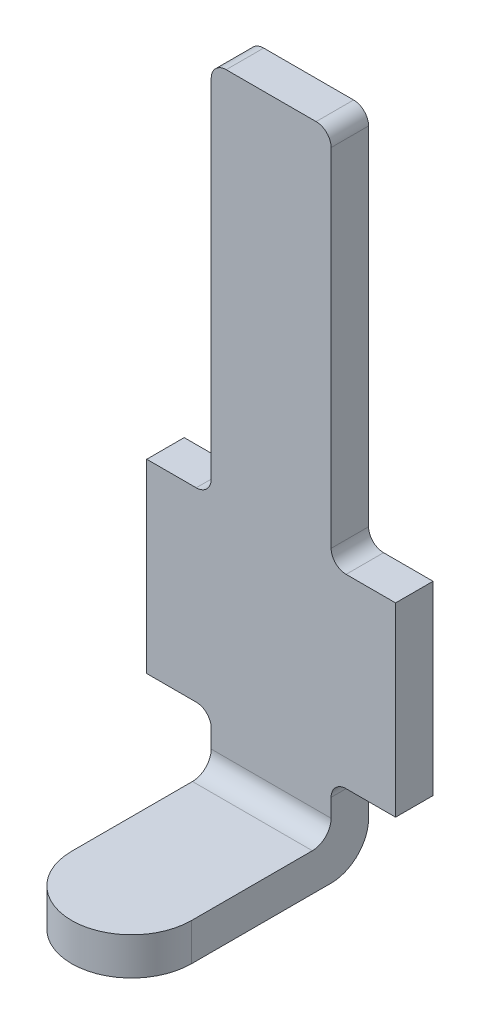
ISO-10303-21;
HEADER;
FILE_DESCRIPTION(('STEP AP214'),'2;1');
FILE_NAME('part.step','',(''),(''),'','','');
FILE_SCHEMA(('AUTOMOTIVE_DESIGN { 1 0 10303 214 1 1 1 1 }'));
ENDSEC;
DATA;
#1=APPLICATION_CONTEXT('core data for automotive mechanical design processes');
#2=APPLICATION_PROTOCOL_DEFINITION('international standard','automotive_design',2000,#1);
#3=PRODUCT_CONTEXT('',#1,'mechanical');
#4=PRODUCT('Part','Part','',(#3));
#5=PRODUCT_RELATED_PRODUCT_CATEGORY('part','',(#4));
#6=PRODUCT_DEFINITION_FORMATION('','',#4);
#7=PRODUCT_DEFINITION_CONTEXT('part definition',#1,'design');
#8=PRODUCT_DEFINITION('design','',#6,#7);
#9=PRODUCT_DEFINITION_SHAPE('','',#8);
#10=(LENGTH_UNIT() NAMED_UNIT(*) SI_UNIT(.MILLI.,.METRE.));
#11=(NAMED_UNIT(*) PLANE_ANGLE_UNIT() SI_UNIT($,.RADIAN.));
#12=(NAMED_UNIT(*) SI_UNIT($,.STERADIAN.) SOLID_ANGLE_UNIT());
#13=UNCERTAINTY_MEASURE_WITH_UNIT(LENGTH_MEASURE(1.E-05),#10,'distance_accuracy_value','');
#14=(GEOMETRIC_REPRESENTATION_CONTEXT(3) GLOBAL_UNCERTAINTY_ASSIGNED_CONTEXT((#13)) GLOBAL_UNIT_ASSIGNED_CONTEXT((#10,
#11,#12)) REPRESENTATION_CONTEXT('',''));
#15=CARTESIAN_POINT('',(0.,0.,0.));
#16=DIRECTION('',(0.,0.,1.));
#17=DIRECTION('',(1.,0.,0.));
#18=AXIS2_PLACEMENT_3D('',#15,#16,#17);
#19=CARTESIAN_POINT('',(-11.93,0.0459658151929143,0.749000000000012));
#20=DIRECTION('',(0.,0.,-1.));
#21=DIRECTION('',(-1.,0.,0.));
#22=AXIS2_PLACEMENT_3D('',#19,#20,#21);
#23=CYLINDRICAL_SURFACE('',#22,0.1);
#24=CARTESIAN_POINT('',(-11.93,0.0459658151929143,0.498999999999983));
#25=DIRECTION('',(0.,0.,1.));
#26=DIRECTION('',(1.,0.,0.));
#27=AXIS2_PLACEMENT_3D('',#24,#25,#26);
#28=CIRCLE('',#27,0.1);
#29=CARTESIAN_POINT('',(-11.83,0.0459658151929143,0.498999999999983));
#30=VERTEX_POINT('',#29);
#31=CARTESIAN_POINT('',(-11.93,0.145965815192914,0.499000000000012));
#32=VERTEX_POINT('',#31);
#33=EDGE_CURVE('E357',#30,#32,#28,.T.);
#34=ORIENTED_EDGE('',*,*,#33,.F.);
#35=DIRECTION('',(0.,0.,-1.));
#36=VECTOR('',#35,1.);
#37=CARTESIAN_POINT('',(-11.83,0.0459658151929143,0.499000000000012));
#38=LINE('',#37,#36);
#39=CARTESIAN_POINT('',(-11.83,0.0459658151929143,0.748999999999983));
#40=VERTEX_POINT('',#39);
#41=EDGE_CURVE('E253',#40,#30,#38,.T.);
#42=ORIENTED_EDGE('',*,*,#41,.F.);
#43=CARTESIAN_POINT('',(-11.93,0.0459658151929143,0.748999999999983));
#44=DIRECTION('',(0.,0.,-1.));
#45=DIRECTION('',(-1.,0.,0.));
#46=AXIS2_PLACEMENT_3D('',#43,#44,#45);
#47=CIRCLE('',#46,0.1);
#48=CARTESIAN_POINT('',(-11.93,0.145965815192914,0.749000000000012));
#49=VERTEX_POINT('',#48);
#50=EDGE_CURVE('E232',#49,#40,#47,.T.);
#51=ORIENTED_EDGE('',*,*,#50,.F.);
#52=DIRECTION('',(0.,0.,1.));
#53=VECTOR('',#52,1.);
#54=CARTESIAN_POINT('',(-11.93,0.145965815192914,0.748999999999983));
#55=LINE('',#54,#53);
#56=EDGE_CURVE('E349',#32,#49,#55,.T.);
#57=ORIENTED_EDGE('',*,*,#56,.F.);
#58=EDGE_LOOP('',(#34,#42,#51,#57));
#59=FACE_BOUND('',#58,.T.);
#60=ADVANCED_FACE('F16',(#59),#23,.F.);
#61=CARTESIAN_POINT('',(-10.93,0.0459658151929143,0.748999999999984));
#62=DIRECTION('',(0.,0.,1.));
#63=DIRECTION('',(1.,0.,0.));
#64=AXIS2_PLACEMENT_3D('',#61,#62,#63);
#65=CYLINDRICAL_SURFACE('',#64,0.1);
#66=CARTESIAN_POINT('',(-10.93,0.0459658151929143,0.498999999999984));
#67=DIRECTION('',(0.,0.,1.));
#68=DIRECTION('',(1.,0.,0.));
#69=AXIS2_PLACEMENT_3D('',#66,#67,#68);
#70=CIRCLE('',#69,0.1);
#71=CARTESIAN_POINT('',(-10.93,0.145965815192914,0.499000000000013));
#72=VERTEX_POINT('',#71);
#73=CARTESIAN_POINT('',(-11.03,0.0459658151929143,0.498999999999984));
#74=VERTEX_POINT('',#73);
#75=EDGE_CURVE('E275',#72,#74,#70,.T.);
#76=ORIENTED_EDGE('',*,*,#75,.F.);
#77=DIRECTION('',(0.,0.,-1.));
#78=VECTOR('',#77,1.);
#79=CARTESIAN_POINT('',(-10.93,0.145965815192914,0.749000000000013));
#80=LINE('',#79,#78);
#81=CARTESIAN_POINT('',(-10.93,0.145965815192914,0.749000000000013));
#82=VERTEX_POINT('',#81);
#83=EDGE_CURVE('E27',#82,#72,#80,.T.);
#84=ORIENTED_EDGE('',*,*,#83,.F.);
#85=CARTESIAN_POINT('',(-10.93,0.0459658151929143,0.748999999999984));
#86=DIRECTION('',(0.,0.,-1.));
#87=DIRECTION('',(-1.,0.,0.));
#88=AXIS2_PLACEMENT_3D('',#85,#86,#87);
#89=CIRCLE('',#88,0.1);
#90=CARTESIAN_POINT('',(-11.03,0.0459658151929143,0.748999999999984));
#91=VERTEX_POINT('',#90);
#92=EDGE_CURVE('E203',#91,#82,#89,.T.);
#93=ORIENTED_EDGE('',*,*,#92,.F.);
#94=DIRECTION('',(0.,0.,1.));
#95=VECTOR('',#94,1.);
#96=CARTESIAN_POINT('',(-11.03,0.0459658151929143,0.748999999999984));
#97=LINE('',#96,#95);
#98=EDGE_CURVE('E186',#74,#91,#97,.T.);
#99=ORIENTED_EDGE('',*,*,#98,.F.);
#100=EDGE_LOOP('',(#76,#84,#93,#99));
#101=FACE_BOUND('',#100,.T.);
#102=ADVANCED_FACE('F204',(#101),#65,.F.);
#103=CARTESIAN_POINT('',(-11.93,1.48437551370885,0.748999999999983));
#104=DIRECTION('',(0.,0.,1.));
#105=DIRECTION('',(1.,0.,0.));
#106=AXIS2_PLACEMENT_3D('',#103,#104,#105);
#107=CYLINDRICAL_SURFACE('',#106,0.1);
#108=CARTESIAN_POINT('',(-11.93,1.48437551370885,0.498999999999983));
#109=DIRECTION('',(0.,0.,1.));
#110=DIRECTION('',(1.,0.,0.));
#111=AXIS2_PLACEMENT_3D('',#108,#109,#110);
#112=CIRCLE('',#111,0.1);
#113=CARTESIAN_POINT('',(-11.93,1.38437551370885,0.499000000000012));
#114=VERTEX_POINT('',#113);
#115=CARTESIAN_POINT('',(-11.83,1.48437551370885,0.498999999999983));
#116=VERTEX_POINT('',#115);
#117=EDGE_CURVE('E360',#114,#116,#112,.T.);
#118=ORIENTED_EDGE('',*,*,#117,.F.);
#119=DIRECTION('',(0.,0.,-1.));
#120=VECTOR('',#119,1.);
#121=CARTESIAN_POINT('',(-11.93,1.38437551370885,0.749000000000012));
#122=LINE('',#121,#120);
#123=CARTESIAN_POINT('',(-11.93,1.38437551370885,0.749000000000012));
#124=VERTEX_POINT('',#123);
#125=EDGE_CURVE('E42',#124,#114,#122,.T.);
#126=ORIENTED_EDGE('',*,*,#125,.F.);
#127=CARTESIAN_POINT('',(-11.93,1.48437551370885,0.748999999999983));
#128=DIRECTION('',(0.,0.,-1.));
#129=DIRECTION('',(-1.,0.,0.));
#130=AXIS2_PLACEMENT_3D('',#127,#128,#129);
#131=CIRCLE('',#130,0.1);
#132=CARTESIAN_POINT('',(-11.83,1.48437551370885,0.748999999999983));
#133=VERTEX_POINT('',#132);
#134=EDGE_CURVE('E313',#133,#124,#131,.T.);
#135=ORIENTED_EDGE('',*,*,#134,.F.);
#136=DIRECTION('',(0.,0.,1.));
#137=VECTOR('',#136,1.);
#138=CARTESIAN_POINT('',(-11.83,1.48437551370885,0.748999999999983));
#139=LINE('',#138,#137);
#140=EDGE_CURVE('E279',#116,#133,#139,.T.);
#141=ORIENTED_EDGE('',*,*,#140,.F.);
#142=EDGE_LOOP('',(#118,#126,#135,#141));
#143=FACE_BOUND('',#142,.T.);
#144=ADVANCED_FACE('F483',(#143),#107,.F.);
#145=CARTESIAN_POINT('',(-10.93,1.48437551370885,0.749000000000014));
#146=DIRECTION('',(0.,0.,-1.));
#147=DIRECTION('',(-1.,0.,0.));
#148=AXIS2_PLACEMENT_3D('',#145,#146,#147);
#149=CYLINDRICAL_SURFACE('',#148,0.1);
#150=CARTESIAN_POINT('',(-10.93,1.48437551370885,0.498999999999985));
#151=DIRECTION('',(0.,0.,1.));
#152=DIRECTION('',(1.,0.,0.));
#153=AXIS2_PLACEMENT_3D('',#150,#151,#152);
#154=CIRCLE('',#153,0.1);
#155=CARTESIAN_POINT('',(-11.03,1.48437551370885,0.498999999999984));
#156=VERTEX_POINT('',#155);
#157=CARTESIAN_POINT('',(-10.93,1.38437551370885,0.499000000000013));
#158=VERTEX_POINT('',#157);
#159=EDGE_CURVE('E265',#156,#158,#154,.T.);
#160=ORIENTED_EDGE('',*,*,#159,.F.);
#161=DIRECTION('',(0.,0.,-1.));
#162=VECTOR('',#161,1.);
#163=CARTESIAN_POINT('',(-11.03,1.48437551370885,0.498999999999984));
#164=LINE('',#163,#162);
#165=CARTESIAN_POINT('',(-11.03,1.48437551370885,0.748999999999984));
#166=VERTEX_POINT('',#165);
#167=EDGE_CURVE('E257',#166,#156,#164,.T.);
#168=ORIENTED_EDGE('',*,*,#167,.F.);
#169=CARTESIAN_POINT('',(-10.93,1.48437551370885,0.748999999999984));
#170=DIRECTION('',(0.,0.,-1.));
#171=DIRECTION('',(-1.,0.,0.));
#172=AXIS2_PLACEMENT_3D('',#169,#170,#171);
#173=CIRCLE('',#172,0.1);
#174=CARTESIAN_POINT('',(-10.93,1.38437551370885,0.749000000000014));
#175=VERTEX_POINT('',#174);
#176=EDGE_CURVE('E238',#175,#166,#173,.T.);
#177=ORIENTED_EDGE('',*,*,#176,.F.);
#178=DIRECTION('',(0.,0.,1.));
#179=VECTOR('',#178,1.);
#180=CARTESIAN_POINT('',(-10.93,1.38437551370885,0.748999999999984));
#181=LINE('',#180,#179);
#182=EDGE_CURVE('E338',#158,#175,#181,.T.);
#183=ORIENTED_EDGE('',*,*,#182,.F.);
#184=EDGE_LOOP('',(#160,#168,#177,#183));
#185=FACE_BOUND('',#184,.T.);
#186=ADVANCED_FACE('F534',(#185),#149,.F.);
#187=CARTESIAN_POINT('',(-11.73,3.8,0.748999999999983));
#188=DIRECTION('',(0.,0.,-1.));
#189=DIRECTION('',(-1.,0.,0.));
#190=AXIS2_PLACEMENT_3D('',#187,#188,#189);
#191=CYLINDRICAL_SURFACE('',#190,0.1);
#192=CARTESIAN_POINT('',(-11.73,3.8,0.498999999999984));
#193=DIRECTION('',(0.,0.,-1.));
#194=DIRECTION('',(1.,0.,0.));
#195=AXIS2_PLACEMENT_3D('',#192,#193,#194);
#196=CIRCLE('',#195,0.1);
#197=CARTESIAN_POINT('',(-11.83,3.8,0.498999999999984));
#198=VERTEX_POINT('',#197);
#199=CARTESIAN_POINT('',(-11.73,3.9,0.498999999999984));
#200=VERTEX_POINT('',#199);
#201=EDGE_CURVE('E200',#198,#200,#196,.T.);
#202=ORIENTED_EDGE('',*,*,#201,.F.);
#203=DIRECTION('',(0.,0.,-1.));
#204=VECTOR('',#203,1.);
#205=CARTESIAN_POINT('',(-11.83,3.8,0.498999999999984));
#206=LINE('',#205,#204);
#207=CARTESIAN_POINT('',(-11.83,3.8,0.748999999999983));
#208=VERTEX_POINT('',#207);
#209=EDGE_CURVE('E315',#208,#198,#206,.T.);
#210=ORIENTED_EDGE('',*,*,#209,.F.);
#211=CARTESIAN_POINT('',(-11.73,3.8,0.748999999999983));
#212=DIRECTION('',(0.,0.,1.));
#213=DIRECTION('',(-1.,0.,0.));
#214=AXIS2_PLACEMENT_3D('',#211,#212,#213);
#215=CIRCLE('',#214,0.1);
#216=CARTESIAN_POINT('',(-11.73,3.9,0.748999999999983));
#217=VERTEX_POINT('',#216);
#218=EDGE_CURVE('E291',#217,#208,#215,.T.);
#219=ORIENTED_EDGE('',*,*,#218,.F.);
#220=DIRECTION('',(0.,0.,1.));
#221=VECTOR('',#220,1.);
#222=CARTESIAN_POINT('',(-11.73,3.9,0.748999999999983));
#223=LINE('',#222,#221);
#224=EDGE_CURVE('E292',#200,#217,#223,.T.);
#225=ORIENTED_EDGE('',*,*,#224,.F.);
#226=EDGE_LOOP('',(#202,#210,#219,#225));
#227=FACE_BOUND('',#226,.T.);
#228=ADVANCED_FACE('F546',(#227),#191,.T.);
#229=CARTESIAN_POINT('',(-11.13,3.8,0.748999999999984));
#230=DIRECTION('',(0.,0.,1.));
#231=DIRECTION('',(1.,0.,0.));
#232=AXIS2_PLACEMENT_3D('',#229,#230,#231);
#233=CYLINDRICAL_SURFACE('',#232,0.1);
#234=CARTESIAN_POINT('',(-11.13,3.8,0.498999999999985));
#235=DIRECTION('',(0.,0.,-1.));
#236=DIRECTION('',(1.,0.,0.));
#237=AXIS2_PLACEMENT_3D('',#234,#235,#236);
#238=CIRCLE('',#237,0.1);
#239=CARTESIAN_POINT('',(-11.13,3.9,0.498999999999985));
#240=VERTEX_POINT('',#239);
#241=CARTESIAN_POINT('',(-11.03,3.8,0.498999999999985));
#242=VERTEX_POINT('',#241);
#243=EDGE_CURVE('E310',#240,#242,#238,.T.);
#244=ORIENTED_EDGE('',*,*,#243,.F.);
#245=DIRECTION('',(0.,0.,-1.));
#246=VECTOR('',#245,1.);
#247=CARTESIAN_POINT('',(-11.13,3.9,0.748999999999984));
#248=LINE('',#247,#246);
#249=CARTESIAN_POINT('',(-11.13,3.9,0.748999999999984));
#250=VERTEX_POINT('',#249);
#251=EDGE_CURVE('E331',#250,#240,#248,.T.);
#252=ORIENTED_EDGE('',*,*,#251,.F.);
#253=CARTESIAN_POINT('',(-11.13,3.8,0.748999999999984));
#254=DIRECTION('',(0.,0.,1.));
#255=DIRECTION('',(-1.,0.,0.));
#256=AXIS2_PLACEMENT_3D('',#253,#254,#255);
#257=CIRCLE('',#256,0.1);
#258=CARTESIAN_POINT('',(-11.03,3.8,0.748999999999984));
#259=VERTEX_POINT('',#258);
#260=EDGE_CURVE('E288',#259,#250,#257,.T.);
#261=ORIENTED_EDGE('',*,*,#260,.F.);
#262=DIRECTION('',(0.,0.,1.));
#263=VECTOR('',#262,1.);
#264=CARTESIAN_POINT('',(-11.03,3.8,0.748999999999984));
#265=LINE('',#264,#263);
#266=EDGE_CURVE('E258',#242,#259,#265,.T.);
#267=ORIENTED_EDGE('',*,*,#266,.F.);
#268=EDGE_LOOP('',(#244,#252,#261,#267));
#269=FACE_BOUND('',#268,.T.);
#270=ADVANCED_FACE('F542',(#269),#233,.T.);
#271=CARTESIAN_POINT('',(-10.6,0.,1.00308650274883E-13));
#272=DIRECTION('',(-1.,0.,0.));
#273=DIRECTION('',(0.,0.,1.));
#274=AXIS2_PLACEMENT_3D('',#271,#272,#273);
#275=PLANE('',#274);
#276=DIRECTION('',(0.,0.,-1.));
#277=VECTOR('',#276,1.);
#278=CARTESIAN_POINT('',(-10.6,1.38437551370885,0.749000000000014));
#279=LINE('',#278,#277);
#280=CARTESIAN_POINT('',(-10.6,1.38437551370885,0.749000000000014));
#281=VERTEX_POINT('',#280);
#282=CARTESIAN_POINT('',(-10.6,1.38437551370885,0.499000000000014));
#283=VERTEX_POINT('',#282);
#284=EDGE_CURVE('E299',#281,#283,#279,.T.);
#285=ORIENTED_EDGE('',*,*,#284,.F.);
#286=DIRECTION('',(0.,-1.,0.));
#287=VECTOR('',#286,1.);
#288=CARTESIAN_POINT('',(-10.6,1.38437551370885,0.749000000000014));
#289=LINE('',#288,#287);
#290=CARTESIAN_POINT('',(-10.6,0.145965815192914,0.749000000000014));
#291=VERTEX_POINT('',#290);
#292=EDGE_CURVE('E239',#281,#291,#289,.T.);
#293=ORIENTED_EDGE('',*,*,#292,.T.);
#294=DIRECTION('',(0.,0.,-1.));
#295=VECTOR('',#294,1.);
#296=CARTESIAN_POINT('',(-10.6,0.145965815192914,0.749000000000014));
#297=LINE('',#296,#295);
#298=CARTESIAN_POINT('',(-10.6,0.145965815192914,0.499000000000014));
#299=VERTEX_POINT('',#298);
#300=EDGE_CURVE('E11',#291,#299,#297,.T.);
#301=ORIENTED_EDGE('',*,*,#300,.T.);
#302=DIRECTION('',(0.,-1.,0.));
#303=VECTOR('',#302,1.);
#304=CARTESIAN_POINT('',(-10.6,1.38437551370885,0.499000000000014));
#305=LINE('',#304,#303);
#306=EDGE_CURVE('E264',#283,#299,#305,.T.);
#307=ORIENTED_EDGE('',*,*,#306,.F.);
#308=EDGE_LOOP('',(#285,#293,#301,#307));
#309=FACE_BOUND('',#308,.T.);
#310=ADVANCED_FACE('F526',(#309),#275,.F.);
#311=CARTESIAN_POINT('',(-12.26,0.145965815192914,0.749000000000011));
#312=DIRECTION('',(0.,-1.,0.));
#313=DIRECTION('',(0.,0.,-1.));
#314=AXIS2_PLACEMENT_3D('',#311,#312,#313);
#315=PLANE('',#314);
#316=DIRECTION('',(1.,0.,0.));
#317=VECTOR('',#316,1.);
#318=CARTESIAN_POINT('',(-12.26,0.145965815192914,0.749000000000011));
#319=LINE('',#318,#317);
#320=EDGE_CURVE('E210',#82,#291,#319,.T.);
#321=ORIENTED_EDGE('',*,*,#320,.F.);
#322=ORIENTED_EDGE('',*,*,#83,.T.);
#323=DIRECTION('',(1.,0.,0.));
#324=VECTOR('',#323,1.);
#325=CARTESIAN_POINT('',(-12.26,0.145965815192914,0.499000000000011));
#326=LINE('',#325,#324);
#327=EDGE_CURVE('E278',#72,#299,#326,.T.);
#328=ORIENTED_EDGE('',*,*,#327,.T.);
#329=ORIENTED_EDGE('',*,*,#300,.F.);
#330=EDGE_LOOP('',(#321,#322,#328,#329));
#331=FACE_BOUND('',#330,.T.);
#332=ADVANCED_FACE('F522',(#331),#315,.T.);
#333=CARTESIAN_POINT('',(-12.26,1.38437551370885,0.749000000000012));
#334=DIRECTION('',(0.,-1.,0.));
#335=DIRECTION('',(0.,0.,-1.));
#336=AXIS2_PLACEMENT_3D('',#333,#334,#335);
#337=PLANE('',#336);
#338=DIRECTION('',(1.,0.,0.));
#339=VECTOR('',#338,1.);
#340=CARTESIAN_POINT('',(-12.26,1.38437551370885,0.499000000000011));
#341=LINE('',#340,#339);
#342=EDGE_CURVE('E260',#158,#283,#341,.T.);
#343=ORIENTED_EDGE('',*,*,#342,.F.);
#344=ORIENTED_EDGE('',*,*,#182,.T.);
#345=DIRECTION('',(1.,0.,0.));
#346=VECTOR('',#345,1.);
#347=CARTESIAN_POINT('',(-12.26,1.38437551370885,0.749000000000012));
#348=LINE('',#347,#346);
#349=EDGE_CURVE('E234',#175,#281,#348,.T.);
#350=ORIENTED_EDGE('',*,*,#349,.T.);
#351=ORIENTED_EDGE('',*,*,#284,.T.);
#352=EDGE_LOOP('',(#343,#344,#350,#351));
#353=FACE_BOUND('',#352,.T.);
#354=ADVANCED_FACE('F532',(#353),#337,.F.);
#355=CARTESIAN_POINT('',(-12.26,1.38437551370885,0.749000000000012));
#356=DIRECTION('',(0.,-1.,0.));
#357=DIRECTION('',(0.,0.,-1.));
#358=AXIS2_PLACEMENT_3D('',#355,#356,#357);
#359=PLANE('',#358);
#360=DIRECTION('',(1.,0.,0.));
#361=VECTOR('',#360,1.);
#362=CARTESIAN_POINT('',(-12.26,1.38437551370885,0.749000000000012));
#363=LINE('',#362,#361);
#364=CARTESIAN_POINT('',(-12.26,1.38437551370885,0.749000000000012));
#365=VERTEX_POINT('',#364);
#366=EDGE_CURVE('E311',#365,#124,#363,.T.);
#367=ORIENTED_EDGE('',*,*,#366,.T.);
#368=ORIENTED_EDGE('',*,*,#125,.T.);
#369=DIRECTION('',(1.,0.,0.));
#370=VECTOR('',#369,1.);
#371=CARTESIAN_POINT('',(-12.26,1.38437551370885,0.499000000000011));
#372=LINE('',#371,#370);
#373=CARTESIAN_POINT('',(-12.26,1.38437551370885,0.499000000000011));
#374=VERTEX_POINT('',#373);
#375=EDGE_CURVE('E383',#374,#114,#372,.T.);
#376=ORIENTED_EDGE('',*,*,#375,.F.);
#377=DIRECTION('',(0.,0.,-1.));
#378=VECTOR('',#377,1.);
#379=CARTESIAN_POINT('',(-12.26,1.38437551370885,0.749000000000012));
#380=LINE('',#379,#378);
#381=EDGE_CURVE('E252',#365,#374,#380,.T.);
#382=ORIENTED_EDGE('',*,*,#381,.F.);
#383=EDGE_LOOP('',(#367,#368,#376,#382));
#384=FACE_BOUND('',#383,.T.);
#385=ADVANCED_FACE('F583',(#384),#359,.F.);
#386=CARTESIAN_POINT('',(-12.26,0.145965815192914,0.749000000000011));
#387=DIRECTION('',(0.,-1.,0.));
#388=DIRECTION('',(0.,0.,-1.));
#389=AXIS2_PLACEMENT_3D('',#386,#387,#388);
#390=PLANE('',#389);
#391=DIRECTION('',(1.,0.,0.));
#392=VECTOR('',#391,1.);
#393=CARTESIAN_POINT('',(-12.26,0.145965815192914,0.499000000000011));
#394=LINE('',#393,#392);
#395=CARTESIAN_POINT('',(-12.26,0.145965815192914,0.499000000000011));
#396=VERTEX_POINT('',#395);
#397=EDGE_CURVE('E394',#396,#32,#394,.T.);
#398=ORIENTED_EDGE('',*,*,#397,.T.);
#399=ORIENTED_EDGE('',*,*,#56,.T.);
#400=DIRECTION('',(1.,0.,0.));
#401=VECTOR('',#400,1.);
#402=CARTESIAN_POINT('',(-12.26,0.145965815192914,0.749000000000011));
#403=LINE('',#402,#401);
#404=CARTESIAN_POINT('',(-12.26,0.145965815192914,0.749000000000011));
#405=VERTEX_POINT('',#404);
#406=EDGE_CURVE('E228',#405,#49,#403,.T.);
#407=ORIENTED_EDGE('',*,*,#406,.F.);
#408=DIRECTION('',(0.,0.,-1.));
#409=VECTOR('',#408,1.);
#410=CARTESIAN_POINT('',(-12.26,0.145965815192914,0.749000000000011));
#411=LINE('',#410,#409);
#412=EDGE_CURVE('E363',#405,#396,#411,.T.);
#413=ORIENTED_EDGE('',*,*,#412,.T.);
#414=EDGE_LOOP('',(#398,#399,#407,#413));
#415=FACE_BOUND('',#414,.T.);
#416=ADVANCED_FACE('F506',(#415),#390,.T.);
#417=CARTESIAN_POINT('',(-12.26,0.,0.));
#418=DIRECTION('',(-1.,0.,0.));
#419=DIRECTION('',(0.,0.,1.));
#420=AXIS2_PLACEMENT_3D('',#417,#418,#419);
#421=PLANE('',#420);
#422=ORIENTED_EDGE('',*,*,#381,.T.);
#423=DIRECTION('',(0.,-1.,0.));
#424=VECTOR('',#423,1.);
#425=CARTESIAN_POINT('',(-12.26,1.38437551370885,0.499000000000011));
#426=LINE('',#425,#424);
#427=EDGE_CURVE('E20',#374,#396,#426,.T.);
#428=ORIENTED_EDGE('',*,*,#427,.T.);
#429=ORIENTED_EDGE('',*,*,#412,.F.);
#430=DIRECTION('',(0.,-1.,0.));
#431=VECTOR('',#430,1.);
#432=CARTESIAN_POINT('',(-12.26,1.38437551370885,0.749000000000012));
#433=LINE('',#432,#431);
#434=EDGE_CURVE('E233',#365,#405,#433,.T.);
#435=ORIENTED_EDGE('',*,*,#434,.F.);
#436=EDGE_LOOP('',(#422,#428,#429,#435));
#437=FACE_BOUND('',#436,.T.);
#438=ADVANCED_FACE('F510',(#437),#421,.T.);
#439=CARTESIAN_POINT('',(-11.43,-0.2,1.68));
#440=DIRECTION('',(0.,-1.,0.));
#441=DIRECTION('',(0.,0.,-1.));
#442=AXIS2_PLACEMENT_3D('',#439,#440,#441);
#443=CYLINDRICAL_SURFACE('',#442,0.4);
#444=DIRECTION('',(0.,-1.,0.));
#445=VECTOR('',#444,1.);
#446=CARTESIAN_POINT('',(-11.03,-0.2,1.68));
#447=LINE('',#446,#445);
#448=CARTESIAN_POINT('',(-11.03,-0.2,1.68));
#449=VERTEX_POINT('',#448);
#450=CARTESIAN_POINT('',(-11.03,-0.45,1.68));
#451=VERTEX_POINT('',#450);
#452=EDGE_CURVE('E199',#449,#451,#447,.T.);
#453=ORIENTED_EDGE('',*,*,#452,.F.);
#454=CARTESIAN_POINT('',(-11.43,-0.2,1.68));
#455=DIRECTION('',(0.,1.,0.));
#456=DIRECTION('',(0.,0.,-1.));
#457=AXIS2_PLACEMENT_3D('',#454,#455,#456);
#458=CIRCLE('',#457,0.4);
#459=CARTESIAN_POINT('',(-11.83,-0.2,1.68));
#460=VERTEX_POINT('',#459);
#461=EDGE_CURVE('E345',#460,#449,#458,.T.);
#462=ORIENTED_EDGE('',*,*,#461,.F.);
#463=DIRECTION('',(0.,1.,0.));
#464=VECTOR('',#463,1.);
#465=CARTESIAN_POINT('',(-11.83,-0.2,1.68));
#466=LINE('',#465,#464);
#467=CARTESIAN_POINT('',(-11.83,-0.45,1.68));
#468=VERTEX_POINT('',#467);
#469=EDGE_CURVE('E249',#468,#460,#466,.T.);
#470=ORIENTED_EDGE('',*,*,#469,.F.);
#471=CARTESIAN_POINT('',(-11.43,-0.45,1.68));
#472=DIRECTION('',(0.,-1.,0.));
#473=DIRECTION('',(0.,0.,1.));
#474=AXIS2_PLACEMENT_3D('',#471,#472,#473);
#475=CIRCLE('',#474,0.4);
#476=EDGE_CURVE('E248',#451,#468,#475,.T.);
#477=ORIENTED_EDGE('',*,*,#476,.F.);
#478=EDGE_LOOP('',(#453,#462,#470,#477));
#479=FACE_BOUND('',#478,.T.);
#480=ADVANCED_FACE('F441',(#479),#443,.T.);
#481=CARTESIAN_POINT('',(-11.83,-0.2,0.748999999999983));
#482=DIRECTION('',(-1.,0.,0.));
#483=DIRECTION('',(0.,0.,1.));
#484=AXIS2_PLACEMENT_3D('',#481,#482,#483);
#485=PLANE('',#484);
#486=DIRECTION('',(0.,-1.,0.));
#487=VECTOR('',#486,1.);
#488=CARTESIAN_POINT('',(-11.83,3.9,0.748999999999983));
#489=LINE('',#488,#487);
#490=CARTESIAN_POINT('',(-11.83,-0.0749999999999988,0.748999999999983));
#491=VERTEX_POINT('',#490);
#492=EDGE_CURVE('E222',#40,#491,#489,.T.);
#493=ORIENTED_EDGE('',*,*,#492,.F.);
#494=ORIENTED_EDGE('',*,*,#41,.T.);
#495=DIRECTION('',(0.,1.,0.));
#496=VECTOR('',#495,1.);
#497=CARTESIAN_POINT('',(-11.83,3.9,0.498999999999984));
#498=LINE('',#497,#496);
#499=CARTESIAN_POINT('',(-11.83,-0.2,0.498999999999983));
#500=VERTEX_POINT('',#499);
#501=EDGE_CURVE('E353',#500,#30,#498,.T.);
#502=ORIENTED_EDGE('',*,*,#501,.F.);
#503=CARTESIAN_POINT('',(-11.83,-0.2,0.748999999999983));
#504=DIRECTION('',(1.,0.,0.));
#505=DIRECTION('',(0.,0.,1.));
#506=AXIS2_PLACEMENT_3D('',#503,#504,#505);
#507=CIRCLE('',#506,0.25);
#508=CARTESIAN_POINT('',(-11.83,-0.45,0.748999999999983));
#509=VERTEX_POINT('',#508);
#510=EDGE_CURVE('E274',#509,#500,#507,.T.);
#511=ORIENTED_EDGE('',*,*,#510,.F.);
#512=DIRECTION('',(0.,0.,-1.));
#513=VECTOR('',#512,1.);
#514=CARTESIAN_POINT('',(-11.83,-0.45,0.748999999999983));
#515=LINE('',#514,#513);
#516=EDGE_CURVE('E243',#468,#509,#515,.T.);
#517=ORIENTED_EDGE('',*,*,#516,.F.);
#518=ORIENTED_EDGE('',*,*,#469,.T.);
#519=DIRECTION('',(0.,0.,1.));
#520=VECTOR('',#519,1.);
#521=CARTESIAN_POINT('',(-11.83,-0.2,0.873999999999983));
#522=LINE('',#521,#520);
#523=CARTESIAN_POINT('',(-11.83,-0.2,0.873999999999983));
#524=VERTEX_POINT('',#523);
#525=EDGE_CURVE('E341',#524,#460,#522,.T.);
#526=ORIENTED_EDGE('',*,*,#525,.F.);
#527=CARTESIAN_POINT('',(-11.83,-0.0749999999999988,0.873999999999983));
#528=DIRECTION('',(-1.,0.,0.));
#529=DIRECTION('',(0.,0.,1.));
#530=AXIS2_PLACEMENT_3D('',#527,#528,#529);
#531=CIRCLE('',#530,0.125);
#532=EDGE_CURVE('E302',#491,#524,#531,.T.);
#533=ORIENTED_EDGE('',*,*,#532,.F.);
#534=EDGE_LOOP('',(#493,#494,#502,#511,#517,#518,#526,#533));
#535=FACE_BOUND('',#534,.T.);
#536=ADVANCED_FACE('F453',(#535),#485,.T.);
#537=CARTESIAN_POINT('',(-11.03,-0.2,0.748999999999984));
#538=DIRECTION('',(-1.,0.,0.));
#539=DIRECTION('',(0.,0.,1.));
#540=AXIS2_PLACEMENT_3D('',#537,#538,#539);
#541=PLANE('',#540);
#542=DIRECTION('',(0.,1.,0.));
#543=VECTOR('',#542,1.);
#544=CARTESIAN_POINT('',(-11.03,3.9,0.498999999999985));
#545=LINE('',#544,#543);
#546=CARTESIAN_POINT('',(-11.03,-0.2,0.498999999999984));
#547=VERTEX_POINT('',#546);
#548=EDGE_CURVE('E194',#547,#74,#545,.T.);
#549=ORIENTED_EDGE('',*,*,#548,.T.);
#550=ORIENTED_EDGE('',*,*,#98,.T.);
#551=DIRECTION('',(0.,-1.,0.));
#552=VECTOR('',#551,1.);
#553=CARTESIAN_POINT('',(-11.03,3.9,0.748999999999984));
#554=LINE('',#553,#552);
#555=CARTESIAN_POINT('',(-11.03,-0.0749999999999988,0.748999999999984));
#556=VERTEX_POINT('',#555);
#557=EDGE_CURVE('E191',#91,#556,#554,.T.);
#558=ORIENTED_EDGE('',*,*,#557,.T.);
#559=CARTESIAN_POINT('',(-11.03,-0.0749999999999988,0.873999999999984));
#560=DIRECTION('',(-1.,0.,0.));
#561=DIRECTION('',(0.,0.,1.));
#562=AXIS2_PLACEMENT_3D('',#559,#560,#561);
#563=CIRCLE('',#562,0.125);
#564=CARTESIAN_POINT('',(-11.03,-0.2,0.873999999999984));
#565=VERTEX_POINT('',#564);
#566=EDGE_CURVE('E346',#556,#565,#563,.T.);
#567=ORIENTED_EDGE('',*,*,#566,.T.);
#568=DIRECTION('',(0.,0.,1.));
#569=VECTOR('',#568,1.);
#570=CARTESIAN_POINT('',(-11.03,-0.2,0.873999999999984));
#571=LINE('',#570,#569);
#572=EDGE_CURVE('E269',#565,#449,#571,.T.);
#573=ORIENTED_EDGE('',*,*,#572,.T.);
#574=ORIENTED_EDGE('',*,*,#452,.T.);
#575=DIRECTION('',(0.,0.,-1.));
#576=VECTOR('',#575,1.);
#577=CARTESIAN_POINT('',(-11.03,-0.45,0.748999999999984));
#578=LINE('',#577,#576);
#579=CARTESIAN_POINT('',(-11.03,-0.45,0.748999999999984));
#580=VERTEX_POINT('',#579);
#581=EDGE_CURVE('E295',#451,#580,#578,.T.);
#582=ORIENTED_EDGE('',*,*,#581,.T.);
#583=CARTESIAN_POINT('',(-11.03,-0.2,0.748999999999984));
#584=DIRECTION('',(1.,0.,0.));
#585=DIRECTION('',(0.,0.,1.));
#586=AXIS2_PLACEMENT_3D('',#583,#584,#585);
#587=CIRCLE('',#586,0.25);
#588=EDGE_CURVE('E226',#580,#547,#587,.T.);
#589=ORIENTED_EDGE('',*,*,#588,.T.);
#590=EDGE_LOOP('',(#549,#550,#558,#567,#573,#574,#582,#589));
#591=FACE_BOUND('',#590,.T.);
#592=ADVANCED_FACE('F188',(#591),#541,.F.);
#593=CARTESIAN_POINT('',(-11.03,3.9,0.498999999999985));
#594=DIRECTION('',(0.,0.,1.));
#595=DIRECTION('',(1.,0.,0.));
#596=AXIS2_PLACEMENT_3D('',#593,#594,#595);
#597=PLANE('',#596);
#598=DIRECTION('',(-1.,0.,0.));
#599=VECTOR('',#598,1.);
#600=CARTESIAN_POINT('',(-11.03,3.9,0.498999999999985));
#601=LINE('',#600,#599);
#602=EDGE_CURVE('E306',#240,#200,#601,.T.);
#603=ORIENTED_EDGE('',*,*,#602,.F.);
#604=ORIENTED_EDGE('',*,*,#243,.T.);
#605=DIRECTION('',(0.,1.,0.));
#606=VECTOR('',#605,1.);
#607=CARTESIAN_POINT('',(-11.03,3.9,0.498999999999985));
#608=LINE('',#607,#606);
#609=EDGE_CURVE('E367',#156,#242,#608,.T.);
#610=ORIENTED_EDGE('',*,*,#609,.F.);
#611=ORIENTED_EDGE('',*,*,#159,.T.);
#612=ORIENTED_EDGE('',*,*,#342,.T.);
#613=ORIENTED_EDGE('',*,*,#306,.T.);
#614=ORIENTED_EDGE('',*,*,#327,.F.);
#615=ORIENTED_EDGE('',*,*,#75,.T.);
#616=ORIENTED_EDGE('',*,*,#548,.F.);
#617=DIRECTION('',(-1.,0.,0.));
#618=VECTOR('',#617,1.);
#619=CARTESIAN_POINT('',(-11.03,-0.2,0.498999999999984));
#620=LINE('',#619,#618);
#621=EDGE_CURVE('E270',#547,#500,#620,.T.);
#622=ORIENTED_EDGE('',*,*,#621,.T.);
#623=ORIENTED_EDGE('',*,*,#501,.T.);
#624=ORIENTED_EDGE('',*,*,#33,.T.);
#625=ORIENTED_EDGE('',*,*,#397,.F.);
#626=ORIENTED_EDGE('',*,*,#427,.F.);
#627=ORIENTED_EDGE('',*,*,#375,.T.);
#628=ORIENTED_EDGE('',*,*,#117,.T.);
#629=DIRECTION('',(0.,1.,0.));
#630=VECTOR('',#629,1.);
#631=CARTESIAN_POINT('',(-11.83,3.9,0.498999999999984));
#632=LINE('',#631,#630);
#633=EDGE_CURVE('E284',#116,#198,#632,.T.);
#634=ORIENTED_EDGE('',*,*,#633,.T.);
#635=ORIENTED_EDGE('',*,*,#201,.T.);
#636=EDGE_LOOP('',(#603,#604,#610,#611,#612,#613,#614,#615,#616,#622,#623,#624,#625,#626,#627,
#628,#634,#635));
#637=FACE_BOUND('',#636,.T.);
#638=ADVANCED_FACE('F465',(#637),#597,.F.);
#639=CARTESIAN_POINT('',(-11.03,-0.2,0.748999999999984));
#640=DIRECTION('',(-1.,0.,0.));
#641=DIRECTION('',(0.,0.,1.));
#642=AXIS2_PLACEMENT_3D('',#639,#640,#641);
#643=CYLINDRICAL_SURFACE('',#642,0.25);
#644=ORIENTED_EDGE('',*,*,#510,.T.);
#645=ORIENTED_EDGE('',*,*,#621,.F.);
#646=ORIENTED_EDGE('',*,*,#588,.F.);
#647=DIRECTION('',(-1.,0.,0.));
#648=VECTOR('',#647,1.);
#649=CARTESIAN_POINT('',(-11.03,-0.45,0.748999999999984));
#650=LINE('',#649,#648);
#651=EDGE_CURVE('E247',#580,#509,#650,.T.);
#652=ORIENTED_EDGE('',*,*,#651,.T.);
#653=EDGE_LOOP('',(#644,#645,#646,#652));
#654=FACE_BOUND('',#653,.T.);
#655=ADVANCED_FACE('F462',(#654),#643,.T.);
#656=CARTESIAN_POINT('',(-11.03,-0.45,0.748999999999984));
#657=DIRECTION('',(0.,1.,0.));
#658=DIRECTION('',(0.,0.,-1.));
#659=AXIS2_PLACEMENT_3D('',#656,#657,#658);
#660=PLANE('',#659);
#661=ORIENTED_EDGE('',*,*,#476,.T.);
#662=ORIENTED_EDGE('',*,*,#516,.T.);
#663=ORIENTED_EDGE('',*,*,#651,.F.);
#664=ORIENTED_EDGE('',*,*,#581,.F.);
#665=EDGE_LOOP('',(#661,#662,#663,#664));
#666=FACE_BOUND('',#665,.T.);
#667=ADVANCED_FACE('F458',(#666),#660,.F.);
#668=CARTESIAN_POINT('',(-11.03,-0.2,0.873999999999984));
#669=DIRECTION('',(0.,-1.,0.));
#670=DIRECTION('',(0.,0.,-1.));
#671=AXIS2_PLACEMENT_3D('',#668,#669,#670);
#672=PLANE('',#671);
#673=ORIENTED_EDGE('',*,*,#525,.T.);
#674=ORIENTED_EDGE('',*,*,#461,.T.);
#675=ORIENTED_EDGE('',*,*,#572,.F.);
#676=DIRECTION('',(-1.,0.,0.));
#677=VECTOR('',#676,1.);
#678=CARTESIAN_POINT('',(-11.03,-0.2,0.873999999999984));
#679=LINE('',#678,#677);
#680=EDGE_CURVE('E379',#565,#524,#679,.T.);
#681=ORIENTED_EDGE('',*,*,#680,.T.);
#682=EDGE_LOOP('',(#673,#674,#675,#681));
#683=FACE_BOUND('',#682,.T.);
#684=ADVANCED_FACE('F449',(#683),#672,.F.);
#685=CARTESIAN_POINT('',(-11.03,-0.0749999999999988,0.873999999999984));
#686=DIRECTION('',(-1.,0.,0.));
#687=DIRECTION('',(0.,0.,1.));
#688=AXIS2_PLACEMENT_3D('',#685,#686,#687);
#689=CYLINDRICAL_SURFACE('',#688,0.125);
#690=ORIENTED_EDGE('',*,*,#532,.T.);
#691=ORIENTED_EDGE('',*,*,#680,.F.);
#692=ORIENTED_EDGE('',*,*,#566,.F.);
#693=DIRECTION('',(-1.,0.,0.));
#694=VECTOR('',#693,1.);
#695=CARTESIAN_POINT('',(-11.03,-0.0749999999999988,0.748999999999984));
#696=LINE('',#695,#694);
#697=EDGE_CURVE('E216',#556,#491,#696,.T.);
#698=ORIENTED_EDGE('',*,*,#697,.T.);
#699=EDGE_LOOP('',(#690,#691,#692,#698));
#700=FACE_BOUND('',#699,.T.);
#701=ADVANCED_FACE('F580',(#700),#689,.F.);
#702=CARTESIAN_POINT('',(-11.03,3.9,0.748999999999984));
#703=DIRECTION('',(0.,0.,-1.));
#704=DIRECTION('',(0.,-1.,0.));
#705=AXIS2_PLACEMENT_3D('',#702,#703,#704);
#706=PLANE('',#705);
#707=DIRECTION('',(0.,-1.,0.));
#708=VECTOR('',#707,1.);
#709=CARTESIAN_POINT('',(-11.03,3.9,0.748999999999984));
#710=LINE('',#709,#708);
#711=EDGE_CURVE('E254',#259,#166,#710,.T.);
#712=ORIENTED_EDGE('',*,*,#711,.F.);
#713=ORIENTED_EDGE('',*,*,#260,.T.);
#714=DIRECTION('',(-1.,0.,0.));
#715=VECTOR('',#714,1.);
#716=CARTESIAN_POINT('',(-11.03,3.9,0.748999999999984));
#717=LINE('',#716,#715);
#718=EDGE_CURVE('E283',#250,#217,#717,.T.);
#719=ORIENTED_EDGE('',*,*,#718,.T.);
#720=ORIENTED_EDGE('',*,*,#218,.T.);
#721=DIRECTION('',(0.,-1.,0.));
#722=VECTOR('',#721,1.);
#723=CARTESIAN_POINT('',(-11.83,3.9,0.748999999999983));
#724=LINE('',#723,#722);
#725=EDGE_CURVE('E319',#208,#133,#724,.T.);
#726=ORIENTED_EDGE('',*,*,#725,.T.);
#727=ORIENTED_EDGE('',*,*,#134,.T.);
#728=ORIENTED_EDGE('',*,*,#366,.F.);
#729=ORIENTED_EDGE('',*,*,#434,.T.);
#730=ORIENTED_EDGE('',*,*,#406,.T.);
#731=ORIENTED_EDGE('',*,*,#50,.T.);
#732=ORIENTED_EDGE('',*,*,#492,.T.);
#733=ORIENTED_EDGE('',*,*,#697,.F.);
#734=ORIENTED_EDGE('',*,*,#557,.F.);
#735=ORIENTED_EDGE('',*,*,#92,.T.);
#736=ORIENTED_EDGE('',*,*,#320,.T.);
#737=ORIENTED_EDGE('',*,*,#292,.F.);
#738=ORIENTED_EDGE('',*,*,#349,.F.);
#739=ORIENTED_EDGE('',*,*,#176,.T.);
#740=EDGE_LOOP('',(#712,#713,#719,#720,#726,#727,#728,#729,#730,#731,#732,#733,#734,#735,#736,
#737,#738,#739));
#741=FACE_BOUND('',#740,.T.);
#742=ADVANCED_FACE('F213',(#741),#706,.F.);
#743=CARTESIAN_POINT('',(-11.03,3.9,0.748999999999984));
#744=DIRECTION('',(0.,-1.,0.));
#745=DIRECTION('',(0.,0.,-1.));
#746=AXIS2_PLACEMENT_3D('',#743,#744,#745);
#747=PLANE('',#746);
#748=ORIENTED_EDGE('',*,*,#718,.F.);
#749=ORIENTED_EDGE('',*,*,#251,.T.);
#750=ORIENTED_EDGE('',*,*,#602,.T.);
#751=ORIENTED_EDGE('',*,*,#224,.T.);
#752=EDGE_LOOP('',(#748,#749,#750,#751));
#753=FACE_BOUND('',#752,.T.);
#754=ADVANCED_FACE('F18',(#753),#747,.F.);
#755=CARTESIAN_POINT('',(-11.83,-0.2,0.748999999999983));
#756=DIRECTION('',(-1.,0.,0.));
#757=DIRECTION('',(0.,0.,1.));
#758=AXIS2_PLACEMENT_3D('',#755,#756,#757);
#759=PLANE('',#758);
#760=ORIENTED_EDGE('',*,*,#725,.F.);
#761=ORIENTED_EDGE('',*,*,#209,.T.);
#762=ORIENTED_EDGE('',*,*,#633,.F.);
#763=ORIENTED_EDGE('',*,*,#140,.T.);
#764=EDGE_LOOP('',(#760,#761,#762,#763));
#765=FACE_BOUND('',#764,.T.);
#766=ADVANCED_FACE('F410',(#765),#759,.T.);
#767=CARTESIAN_POINT('',(-11.03,-0.2,0.748999999999984));
#768=DIRECTION('',(-1.,0.,0.));
#769=DIRECTION('',(0.,0.,1.));
#770=AXIS2_PLACEMENT_3D('',#767,#768,#769);
#771=PLANE('',#770);
#772=ORIENTED_EDGE('',*,*,#609,.T.);
#773=ORIENTED_EDGE('',*,*,#266,.T.);
#774=ORIENTED_EDGE('',*,*,#711,.T.);
#775=ORIENTED_EDGE('',*,*,#167,.T.);
#776=EDGE_LOOP('',(#772,#773,#774,#775));
#777=FACE_BOUND('',#776,.T.);
#778=ADVANCED_FACE('F537',(#777),#771,.F.);
#779=CLOSED_SHELL('',(#60,#102,#144,#186,#228,#270,#310,#332,#354,#385,#416,#438,#480,#536,#592,
#638,#655,#667,#684,#701,#742,#754,#766,#778));
#780=MANIFOLD_SOLID_BREP('B1',#779);
#781=ADVANCED_BREP_SHAPE_REPRESENTATION('',(#18,#780),#14);
#782=SHAPE_DEFINITION_REPRESENTATION(#9,#781);
ENDSEC;
END-ISO-10303-21;
